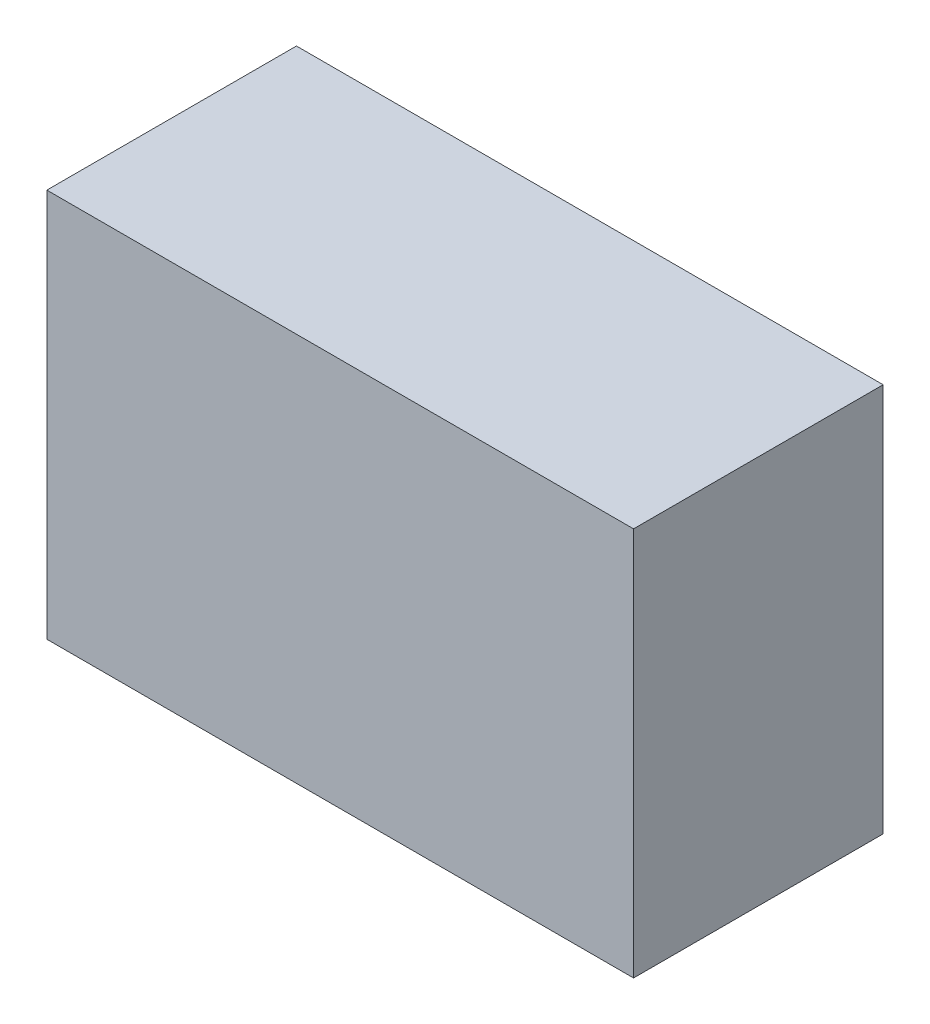
ISO-10303-21;
HEADER;
FILE_DESCRIPTION(('STEP AP214'),'2;1');
FILE_NAME('part.step','',(''),(''),'','','');
FILE_SCHEMA(('AUTOMOTIVE_DESIGN { 1 0 10303 214 1 1 1 1 }'));
ENDSEC;
DATA;
#1=APPLICATION_CONTEXT('core data for automotive mechanical design processes');
#2=APPLICATION_PROTOCOL_DEFINITION('international standard','automotive_design',2000,#1);
#3=PRODUCT_CONTEXT('',#1,'mechanical');
#4=PRODUCT('Part','Part','',(#3));
#5=PRODUCT_RELATED_PRODUCT_CATEGORY('part','',(#4));
#6=PRODUCT_DEFINITION_FORMATION('','',#4);
#7=PRODUCT_DEFINITION_CONTEXT('part definition',#1,'design');
#8=PRODUCT_DEFINITION('design','',#6,#7);
#9=PRODUCT_DEFINITION_SHAPE('','',#8);
#10=(LENGTH_UNIT() NAMED_UNIT(*) SI_UNIT(.MILLI.,.METRE.));
#11=(NAMED_UNIT(*) PLANE_ANGLE_UNIT() SI_UNIT($,.RADIAN.));
#12=(NAMED_UNIT(*) SI_UNIT($,.STERADIAN.) SOLID_ANGLE_UNIT());
#13=UNCERTAINTY_MEASURE_WITH_UNIT(LENGTH_MEASURE(1.E-05),#10,'distance_accuracy_value','');
#14=(GEOMETRIC_REPRESENTATION_CONTEXT(3) GLOBAL_UNCERTAINTY_ASSIGNED_CONTEXT((#13)) GLOBAL_UNIT_ASSIGNED_CONTEXT((#10,
#11,#12)) REPRESENTATION_CONTEXT('',''));
#15=CARTESIAN_POINT('',(0.,0.,0.));
#16=DIRECTION('',(0.,0.,1.));
#17=DIRECTION('',(1.,0.,0.));
#18=AXIS2_PLACEMENT_3D('',#15,#16,#17);
#19=CARTESIAN_POINT('',(-41.9135791290569,28.0949152542373,38.5));
#20=DIRECTION('',(1.,0.,0.));
#21=DIRECTION('',(0.,0.,-1.));
#22=AXIS2_PLACEMENT_3D('',#19,#20,#21);
#23=PLANE('',#22);
#24=DIRECTION('',(0.,-1.,0.));
#25=VECTOR('',#24,1.);
#26=CARTESIAN_POINT('',(-41.9135791290569,28.0949152542373,0.));
#27=LINE('',#26,#25);
#28=CARTESIAN_POINT('',(-41.9135791290569,28.0949152542373,0.));
#29=VERTEX_POINT('',#28);
#30=CARTESIAN_POINT('',(-41.9135791290569,-31.9050847457627,0.));
#31=VERTEX_POINT('',#30);
#32=EDGE_CURVE('E98',#29,#31,#27,.T.);
#33=ORIENTED_EDGE('',*,*,#32,.T.);
#34=DIRECTION('',(0.,0.,-1.));
#35=VECTOR('',#34,1.);
#36=CARTESIAN_POINT('',(-41.9135791290569,-31.9050847457627,38.5));
#37=LINE('',#36,#35);
#38=CARTESIAN_POINT('',(-41.9135791290569,-31.9050847457627,38.5));
#39=VERTEX_POINT('',#38);
#40=EDGE_CURVE('E11',#39,#31,#37,.T.);
#41=ORIENTED_EDGE('',*,*,#40,.F.);
#42=DIRECTION('',(0.,-1.,0.));
#43=VECTOR('',#42,1.);
#44=CARTESIAN_POINT('',(-41.9135791290569,28.0949152542373,38.5));
#45=LINE('',#44,#43);
#46=CARTESIAN_POINT('',(-41.9135791290569,28.0949152542373,38.5));
#47=VERTEX_POINT('',#46);
#48=EDGE_CURVE('E86',#47,#39,#45,.T.);
#49=ORIENTED_EDGE('',*,*,#48,.F.);
#50=DIRECTION('',(0.,0.,-1.));
#51=VECTOR('',#50,1.);
#52=CARTESIAN_POINT('',(-41.9135791290569,28.0949152542373,38.5));
#53=LINE('',#52,#51);
#54=EDGE_CURVE('E94',#47,#29,#53,.T.);
#55=ORIENTED_EDGE('',*,*,#54,.T.);
#56=EDGE_LOOP('',(#33,#41,#49,#55));
#57=FACE_BOUND('',#56,.T.);
#58=ADVANCED_FACE('F35',(#57),#23,.F.);
#59=CARTESIAN_POINT('',(-41.9135791290569,-31.9050847457627,38.5));
#60=DIRECTION('',(0.,1.,0.));
#61=DIRECTION('',(0.,0.,1.));
#62=AXIS2_PLACEMENT_3D('',#59,#60,#61);
#63=PLANE('',#62);
#64=DIRECTION('',(1.,0.,0.));
#65=VECTOR('',#64,1.);
#66=CARTESIAN_POINT('',(-41.9135791290569,-31.9050847457627,0.));
#67=LINE('',#66,#65);
#68=CARTESIAN_POINT('',(48.5864208709431,-31.9050847457627,0.));
#69=VERTEX_POINT('',#68);
#70=EDGE_CURVE('E90',#31,#69,#67,.T.);
#71=ORIENTED_EDGE('',*,*,#70,.T.);
#72=DIRECTION('',(0.,0.,-1.));
#73=VECTOR('',#72,1.);
#74=CARTESIAN_POINT('',(48.5864208709431,-31.9050847457627,38.5));
#75=LINE('',#74,#73);
#76=CARTESIAN_POINT('',(48.5864208709431,-31.9050847457627,38.5));
#77=VERTEX_POINT('',#76);
#78=EDGE_CURVE('E43',#77,#69,#75,.T.);
#79=ORIENTED_EDGE('',*,*,#78,.F.);
#80=DIRECTION('',(1.,0.,0.));
#81=VECTOR('',#80,1.);
#82=CARTESIAN_POINT('',(-41.9135791290569,-31.9050847457627,38.5));
#83=LINE('',#82,#81);
#84=EDGE_CURVE('E81',#39,#77,#83,.T.);
#85=ORIENTED_EDGE('',*,*,#84,.F.);
#86=ORIENTED_EDGE('',*,*,#40,.T.);
#87=EDGE_LOOP('',(#71,#79,#85,#86));
#88=FACE_BOUND('',#87,.T.);
#89=ADVANCED_FACE('F89',(#88),#63,.F.);
#90=CARTESIAN_POINT('',(48.5864208709431,28.0949152542373,38.5));
#91=DIRECTION('',(-1.,0.,0.));
#92=DIRECTION('',(0.,0.,1.));
#93=AXIS2_PLACEMENT_3D('',#90,#91,#92);
#94=PLANE('',#93);
#95=DIRECTION('',(0.,1.,0.));
#96=VECTOR('',#95,1.);
#97=CARTESIAN_POINT('',(48.5864208709431,28.0949152542373,0.));
#98=LINE('',#97,#96);
#99=CARTESIAN_POINT('',(48.5864208709431,28.0949152542373,0.));
#100=VERTEX_POINT('',#99);
#101=EDGE_CURVE('E68',#69,#100,#98,.T.);
#102=ORIENTED_EDGE('',*,*,#101,.T.);
#103=DIRECTION('',(0.,0.,-1.));
#104=VECTOR('',#103,1.);
#105=CARTESIAN_POINT('',(48.5864208709431,28.0949152542373,38.5));
#106=LINE('',#105,#104);
#107=CARTESIAN_POINT('',(48.5864208709431,28.0949152542373,38.5));
#108=VERTEX_POINT('',#107);
#109=EDGE_CURVE('E91',#108,#100,#106,.T.);
#110=ORIENTED_EDGE('',*,*,#109,.F.);
#111=DIRECTION('',(0.,1.,0.));
#112=VECTOR('',#111,1.);
#113=CARTESIAN_POINT('',(48.5864208709431,28.0949152542373,38.5));
#114=LINE('',#113,#112);
#115=EDGE_CURVE('E84',#77,#108,#114,.T.);
#116=ORIENTED_EDGE('',*,*,#115,.F.);
#117=ORIENTED_EDGE('',*,*,#78,.T.);
#118=EDGE_LOOP('',(#102,#110,#116,#117));
#119=FACE_BOUND('',#118,.T.);
#120=ADVANCED_FACE('F92',(#119),#94,.F.);
#121=CARTESIAN_POINT('',(-41.9135791290569,28.0949152542373,38.5));
#122=DIRECTION('',(0.,-1.,0.));
#123=DIRECTION('',(0.,0.,-1.));
#124=AXIS2_PLACEMENT_3D('',#121,#122,#123);
#125=PLANE('',#124);
#126=DIRECTION('',(-1.,0.,0.));
#127=VECTOR('',#126,1.);
#128=CARTESIAN_POINT('',(-41.9135791290569,28.0949152542373,0.));
#129=LINE('',#128,#127);
#130=EDGE_CURVE('E74',#100,#29,#129,.T.);
#131=ORIENTED_EDGE('',*,*,#130,.T.);
#132=ORIENTED_EDGE('',*,*,#54,.F.);
#133=DIRECTION('',(-1.,0.,0.));
#134=VECTOR('',#133,1.);
#135=CARTESIAN_POINT('',(-41.9135791290569,28.0949152542373,38.5));
#136=LINE('',#135,#134);
#137=EDGE_CURVE('E51',#108,#47,#136,.T.);
#138=ORIENTED_EDGE('',*,*,#137,.F.);
#139=ORIENTED_EDGE('',*,*,#109,.T.);
#140=EDGE_LOOP('',(#131,#132,#138,#139));
#141=FACE_BOUND('',#140,.T.);
#142=ADVANCED_FACE('F105',(#141),#125,.F.);
#143=CARTESIAN_POINT('',(0.,0.,38.5));
#144=DIRECTION('',(0.,0.,1.));
#145=DIRECTION('',(1.,0.,0.));
#146=AXIS2_PLACEMENT_3D('',#143,#144,#145);
#147=PLANE('',#146);
#148=ORIENTED_EDGE('',*,*,#48,.T.);
#149=ORIENTED_EDGE('',*,*,#84,.T.);
#150=ORIENTED_EDGE('',*,*,#115,.T.);
#151=ORIENTED_EDGE('',*,*,#137,.T.);
#152=EDGE_LOOP('',(#148,#149,#150,#151));
#153=FACE_BOUND('',#152,.T.);
#154=ADVANCED_FACE('F82',(#153),#147,.T.);
#155=CARTESIAN_POINT('',(0.,0.,0.));
#156=DIRECTION('',(0.,0.,1.));
#157=DIRECTION('',(1.,0.,0.));
#158=AXIS2_PLACEMENT_3D('',#155,#156,#157);
#159=PLANE('',#158);
#160=ORIENTED_EDGE('',*,*,#32,.F.);
#161=ORIENTED_EDGE('',*,*,#130,.F.);
#162=ORIENTED_EDGE('',*,*,#101,.F.);
#163=ORIENTED_EDGE('',*,*,#70,.F.);
#164=EDGE_LOOP('',(#160,#161,#162,#163));
#165=FACE_BOUND('',#164,.T.);
#166=ADVANCED_FACE('F108',(#165),#159,.F.);
#167=CLOSED_SHELL('',(#58,#89,#120,#142,#154,#166));
#168=MANIFOLD_SOLID_BREP('B2',#167);
#169=ADVANCED_BREP_SHAPE_REPRESENTATION('',(#18,#168),#14);
#170=SHAPE_DEFINITION_REPRESENTATION(#9,#169);
ENDSEC;
END-ISO-10303-21;
